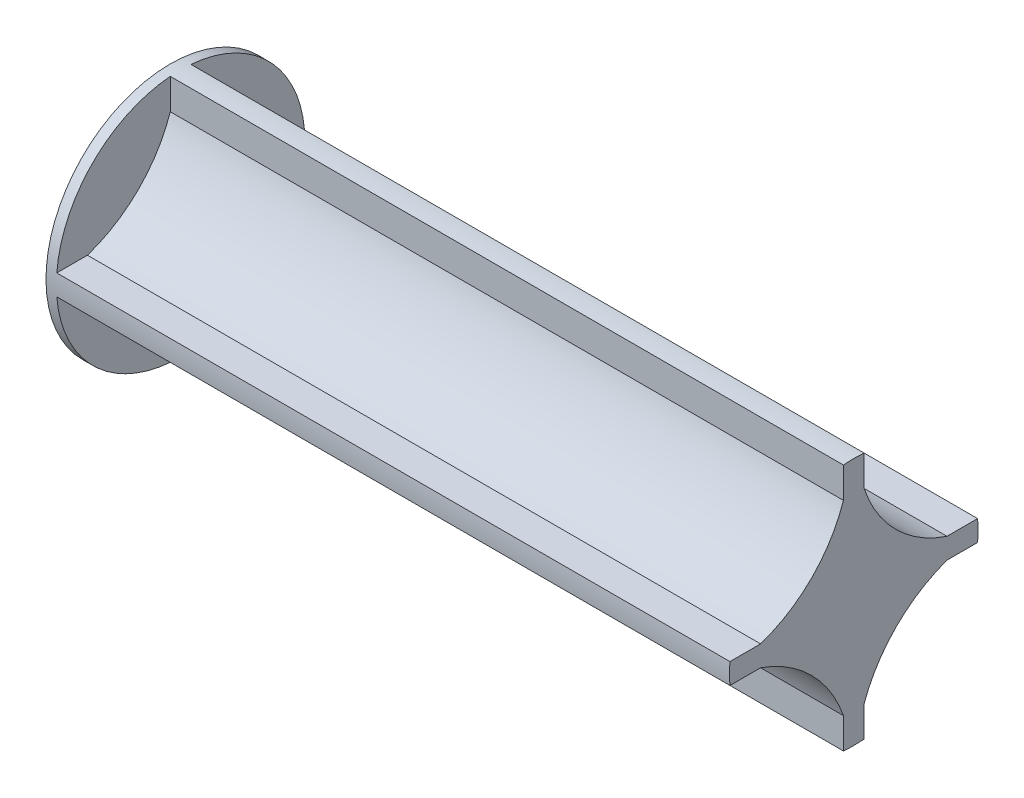
ISO-10303-21;
HEADER;
FILE_DESCRIPTION(('STEP AP214'),'2;1');
FILE_NAME('part.step','',(''),(''),'','','');
FILE_SCHEMA(('AUTOMOTIVE_DESIGN { 1 0 10303 214 1 1 1 1 }'));
ENDSEC;
DATA;
#1=APPLICATION_CONTEXT('core data for automotive mechanical design processes');
#2=APPLICATION_PROTOCOL_DEFINITION('international standard','automotive_design',2000,#1);
#3=PRODUCT_CONTEXT('',#1,'mechanical');
#4=PRODUCT('Part','Part','',(#3));
#5=PRODUCT_RELATED_PRODUCT_CATEGORY('part','',(#4));
#6=PRODUCT_DEFINITION_FORMATION('','',#4);
#7=PRODUCT_DEFINITION_CONTEXT('part definition',#1,'design');
#8=PRODUCT_DEFINITION('design','',#6,#7);
#9=PRODUCT_DEFINITION_SHAPE('','',#8);
#10=(LENGTH_UNIT() NAMED_UNIT(*) SI_UNIT(.MILLI.,.METRE.));
#11=(NAMED_UNIT(*) PLANE_ANGLE_UNIT() SI_UNIT($,.RADIAN.));
#12=(NAMED_UNIT(*) SI_UNIT($,.STERADIAN.) SOLID_ANGLE_UNIT());
#13=UNCERTAINTY_MEASURE_WITH_UNIT(LENGTH_MEASURE(1.E-05),#10,'distance_accuracy_value','');
#14=(GEOMETRIC_REPRESENTATION_CONTEXT(3) GLOBAL_UNCERTAINTY_ASSIGNED_CONTEXT((#13)) GLOBAL_UNIT_ASSIGNED_CONTEXT((#10,
#11,#12)) REPRESENTATION_CONTEXT('',''));
#15=CARTESIAN_POINT('',(0.,0.,0.));
#16=DIRECTION('',(0.,0.,1.));
#17=DIRECTION('',(1.,0.,0.));
#18=AXIS2_PLACEMENT_3D('',#15,#16,#17);
#19=CARTESIAN_POINT('',(66.,0.,0.));
#20=DIRECTION('',(-1.,0.,0.));
#21=DIRECTION('',(0.,0.,1.));
#22=AXIS2_PLACEMENT_3D('',#19,#20,#21);
#23=CYLINDRICAL_SURFACE('',#22,12.);
#24=CARTESIAN_POINT('',(0.,0.,0.));
#25=DIRECTION('',(1.,0.,0.));
#26=DIRECTION('',(0.,0.,-1.));
#27=AXIS2_PLACEMENT_3D('',#24,#25,#26);
#28=CIRCLE('',#27,12.);
#29=CARTESIAN_POINT('',(0.,0.,-12.));
#30=VERTEX_POINT('',#29);
#31=EDGE_CURVE('E359',#30,#30,#28,.T.);
#32=ORIENTED_EDGE('',*,*,#31,.T.);
#33=EDGE_LOOP('',(#32));
#34=FACE_BOUND('',#33,.T.);
#35=DIRECTION('',(1.,0.,0.));
#36=VECTOR('',#35,1.);
#37=CARTESIAN_POINT('',(1.,-11.9582607431014,0.999999999999843));
#38=LINE('',#37,#36);
#39=CARTESIAN_POINT('',(1.,-11.9582607431014,0.999999999999843));
#40=VERTEX_POINT('',#39);
#41=CARTESIAN_POINT('',(66.,-11.9582607431014,0.999999999999843));
#42=VERTEX_POINT('',#41);
#43=EDGE_CURVE('E274',#40,#42,#38,.T.);
#44=ORIENTED_EDGE('',*,*,#43,.F.);
#45=CARTESIAN_POINT('',(1.,0.,0.));
#46=DIRECTION('',(1.,0.,0.));
#47=DIRECTION('',(0.,0.,-1.));
#48=AXIS2_PLACEMENT_3D('',#45,#46,#47);
#49=CIRCLE('',#48,12.);
#50=CARTESIAN_POINT('',(1.,-1.00000000000026,11.9582607431014));
#51=VERTEX_POINT('',#50);
#52=EDGE_CURVE('E253',#51,#40,#49,.T.);
#53=ORIENTED_EDGE('',*,*,#52,.F.);
#54=DIRECTION('',(1.,0.,0.));
#55=VECTOR('',#54,1.);
#56=CARTESIAN_POINT('',(1.,-1.00000000000026,11.9582607431014));
#57=LINE('',#56,#55);
#58=CARTESIAN_POINT('',(66.,-1.00000000000026,11.9582607431014));
#59=VERTEX_POINT('',#58);
#60=EDGE_CURVE('E276',#51,#59,#57,.T.);
#61=ORIENTED_EDGE('',*,*,#60,.T.);
#62=CARTESIAN_POINT('',(66.,0.,0.));
#63=DIRECTION('',(1.,0.,0.));
#64=DIRECTION('',(0.,0.,-1.));
#65=AXIS2_PLACEMENT_3D('',#62,#63,#64);
#66=CIRCLE('',#65,12.);
#67=CARTESIAN_POINT('',(66.,1.00000000000002,11.9582607431014));
#68=VERTEX_POINT('',#67);
#69=EDGE_CURVE('E367',#68,#59,#66,.T.);
#70=ORIENTED_EDGE('',*,*,#69,.F.);
#71=DIRECTION('',(1.,0.,0.));
#72=VECTOR('',#71,1.);
#73=CARTESIAN_POINT('',(1.,1.00000000000002,11.9582607431014));
#74=LINE('',#73,#72);
#75=CARTESIAN_POINT('',(1.,1.00000000000002,11.9582607431014));
#76=VERTEX_POINT('',#75);
#77=EDGE_CURVE('E357',#76,#68,#74,.T.);
#78=ORIENTED_EDGE('',*,*,#77,.F.);
#79=CARTESIAN_POINT('',(1.,0.,0.));
#80=DIRECTION('',(1.,0.,0.));
#81=DIRECTION('',(0.,0.,-1.));
#82=AXIS2_PLACEMENT_3D('',#79,#80,#81);
#83=CIRCLE('',#82,12.);
#84=CARTESIAN_POINT('',(1.,11.9582607431014,1.00000000000002));
#85=VERTEX_POINT('',#84);
#86=EDGE_CURVE('E347',#85,#76,#83,.T.);
#87=ORIENTED_EDGE('',*,*,#86,.F.);
#88=DIRECTION('',(1.,0.,0.));
#89=VECTOR('',#88,1.);
#90=CARTESIAN_POINT('',(1.,11.9582607431014,1.00000000000002));
#91=LINE('',#90,#89);
#92=CARTESIAN_POINT('',(66.,11.9582607431014,1.00000000000002));
#93=VERTEX_POINT('',#92);
#94=EDGE_CURVE('E360',#85,#93,#91,.T.);
#95=ORIENTED_EDGE('',*,*,#94,.T.);
#96=CARTESIAN_POINT('',(66.,11.9582607431014,-1.));
#97=VERTEX_POINT('',#96);
#98=EDGE_CURVE('E371',#97,#93,#66,.T.);
#99=ORIENTED_EDGE('',*,*,#98,.F.);
#100=DIRECTION('',(1.,0.,0.));
#101=VECTOR('',#100,1.);
#102=CARTESIAN_POINT('',(1.,11.9582607431014,-1.));
#103=LINE('',#102,#101);
#104=CARTESIAN_POINT('',(1.,11.9582607431014,-1.));
#105=VERTEX_POINT('',#104);
#106=EDGE_CURVE('E331',#105,#97,#103,.T.);
#107=ORIENTED_EDGE('',*,*,#106,.F.);
#108=CARTESIAN_POINT('',(1.,0.,0.));
#109=DIRECTION('',(1.,0.,0.));
#110=DIRECTION('',(0.,0.,-1.));
#111=AXIS2_PLACEMENT_3D('',#108,#109,#110);
#112=CIRCLE('',#111,12.);
#113=CARTESIAN_POINT('',(1.,0.999999999999858,-11.9582607431014));
#114=VERTEX_POINT('',#113);
#115=EDGE_CURVE('E315',#114,#105,#112,.T.);
#116=ORIENTED_EDGE('',*,*,#115,.F.);
#117=DIRECTION('',(1.,0.,0.));
#118=VECTOR('',#117,1.);
#119=CARTESIAN_POINT('',(1.,0.999999999999858,-11.9582607431014));
#120=LINE('',#119,#118);
#121=CARTESIAN_POINT('',(66.,0.999999999999858,-11.9582607431014));
#122=VERTEX_POINT('',#121);
#123=EDGE_CURVE('E333',#114,#122,#120,.T.);
#124=ORIENTED_EDGE('',*,*,#123,.T.);
#125=CARTESIAN_POINT('',(66.,-1.00000000000008,-11.9582607431014));
#126=VERTEX_POINT('',#125);
#127=EDGE_CURVE('E383',#126,#122,#66,.T.);
#128=ORIENTED_EDGE('',*,*,#127,.F.);
#129=DIRECTION('',(1.,0.,0.));
#130=VECTOR('',#129,1.);
#131=CARTESIAN_POINT('',(1.,-1.00000000000008,-11.9582607431014));
#132=LINE('',#131,#130);
#133=CARTESIAN_POINT('',(1.,-1.00000000000008,-11.9582607431014));
#134=VERTEX_POINT('',#133);
#135=EDGE_CURVE('E303',#134,#126,#132,.T.);
#136=ORIENTED_EDGE('',*,*,#135,.F.);
#137=CARTESIAN_POINT('',(1.,0.,0.));
#138=DIRECTION('',(1.,0.,0.));
#139=DIRECTION('',(0.,0.,-1.));
#140=AXIS2_PLACEMENT_3D('',#137,#138,#139);
#141=CIRCLE('',#140,12.);
#142=CARTESIAN_POINT('',(1.,-11.9582607431014,-1.));
#143=VERTEX_POINT('',#142);
#144=EDGE_CURVE('E288',#143,#134,#141,.T.);
#145=ORIENTED_EDGE('',*,*,#144,.F.);
#146=DIRECTION('',(1.,0.,0.));
#147=VECTOR('',#146,1.);
#148=CARTESIAN_POINT('',(1.,-11.9582607431014,-1.));
#149=LINE('',#148,#147);
#150=CARTESIAN_POINT('',(66.,-11.9582607431014,-1.));
#151=VERTEX_POINT('',#150);
#152=EDGE_CURVE('E305',#143,#151,#149,.T.);
#153=ORIENTED_EDGE('',*,*,#152,.T.);
#154=EDGE_CURVE('E370',#42,#151,#66,.T.);
#155=ORIENTED_EDGE('',*,*,#154,.F.);
#156=EDGE_LOOP('',(#44,#53,#61,#70,#78,#87,#95,#99,#107,#116,#124,#128,#136,#145,#153,#155));
#157=FACE_BOUND('',#156,.T.);
#158=ADVANCED_FACE('F35',(#34,#157),#23,.T.);
#159=CARTESIAN_POINT('',(66.,0.,0.));
#160=DIRECTION('',(1.,0.,0.));
#161=DIRECTION('',(0.,0.,-1.));
#162=AXIS2_PLACEMENT_3D('',#159,#160,#161);
#163=PLANE('',#162);
#164=CARTESIAN_POINT('',(66.,-13.30515446821,13.3051544682096));
#165=DIRECTION('',(1.,0.,0.));
#166=DIRECTION('',(0.,0.,-1.));
#167=AXIS2_PLACEMENT_3D('',#164,#165,#166);
#168=CIRCLE('',#167,13.0365325712648);
#169=CARTESIAN_POINT('',(66.,-9.00000000000013,0.999999999999899));
#170=VERTEX_POINT('',#169);
#171=CARTESIAN_POINT('',(66.,-1.00000000000024,8.99999999999998));
#172=VERTEX_POINT('',#171);
#173=EDGE_CURVE('E269',#170,#172,#168,.T.);
#174=ORIENTED_EDGE('',*,*,#173,.F.);
#175=DIRECTION('',(0.,-1.,0.));
#176=VECTOR('',#175,1.);
#177=CARTESIAN_POINT('',(66.,0.,0.999999999999931));
#178=LINE('',#177,#176);
#179=EDGE_CURVE('E50',#170,#42,#178,.T.);
#180=ORIENTED_EDGE('',*,*,#179,.T.);
#181=ORIENTED_EDGE('',*,*,#154,.T.);
#182=DIRECTION('',(0.,-1.,0.));
#183=VECTOR('',#182,1.);
#184=CARTESIAN_POINT('',(66.,0.,-1.));
#185=LINE('',#184,#183);
#186=CARTESIAN_POINT('',(66.,-9.0000000000001,-1.));
#187=VERTEX_POINT('',#186);
#188=EDGE_CURVE('E295',#187,#151,#185,.T.);
#189=ORIENTED_EDGE('',*,*,#188,.F.);
#190=CARTESIAN_POINT('',(66.,-13.5100557553755,-13.5100557553756));
#191=DIRECTION('',(1.,0.,0.));
#192=DIRECTION('',(0.,0.,-1.));
#193=AXIS2_PLACEMENT_3D('',#190,#191,#192);
#194=CIRCLE('',#193,13.2981990479613);
#195=CARTESIAN_POINT('',(66.,-1.00000000000011,-8.99999999999994));
#196=VERTEX_POINT('',#195);
#197=EDGE_CURVE('E58',#187,#196,#194,.F.);
#198=ORIENTED_EDGE('',*,*,#197,.T.);
#199=DIRECTION('',(0.,0.,-1.));
#200=VECTOR('',#199,1.);
#201=CARTESIAN_POINT('',(66.,-1.00000000000017,0.));
#202=LINE('',#201,#200);
#203=EDGE_CURVE('E285',#196,#126,#202,.T.);
#204=ORIENTED_EDGE('',*,*,#203,.T.);
#205=ORIENTED_EDGE('',*,*,#127,.T.);
#206=DIRECTION('',(0.,0.,-1.));
#207=VECTOR('',#206,1.);
#208=CARTESIAN_POINT('',(66.,0.999999999999937,0.));
#209=LINE('',#208,#207);
#210=CARTESIAN_POINT('',(66.,0.999999999999878,-8.99999999999995));
#211=VERTEX_POINT('',#210);
#212=EDGE_CURVE('E323',#211,#122,#209,.T.);
#213=ORIENTED_EDGE('',*,*,#212,.F.);
#214=CARTESIAN_POINT('',(66.,12.9455938380272,-12.9455938380273));
#215=DIRECTION('',(1.,0.,0.));
#216=DIRECTION('',(0.,0.,-1.));
#217=AXIS2_PLACEMENT_3D('',#214,#215,#216);
#218=CIRCLE('',#217,12.5803387425695);
#219=CARTESIAN_POINT('',(66.,8.99999999999988,-1.));
#220=VERTEX_POINT('',#219);
#221=EDGE_CURVE('E302',#211,#220,#218,.F.);
#222=ORIENTED_EDGE('',*,*,#221,.T.);
#223=DIRECTION('',(0.,-1.,0.));
#224=VECTOR('',#223,1.);
#225=CARTESIAN_POINT('',(66.,0.,-1.));
#226=LINE('',#225,#224);
#227=EDGE_CURVE('E312',#97,#220,#226,.T.);
#228=ORIENTED_EDGE('',*,*,#227,.F.);
#229=ORIENTED_EDGE('',*,*,#98,.T.);
#230=DIRECTION('',(0.,-1.,0.));
#231=VECTOR('',#230,1.);
#232=CARTESIAN_POINT('',(66.,0.,0.999999999999931));
#233=LINE('',#232,#231);
#234=CARTESIAN_POINT('',(66.,9.,0.999999999999997));
#235=VERTEX_POINT('',#234);
#236=EDGE_CURVE('E342',#93,#235,#233,.T.);
#237=ORIENTED_EDGE('',*,*,#236,.T.);
#238=CARTESIAN_POINT('',(66.,13.0095924704432,13.0095924704432));
#239=DIRECTION('',(1.,0.,0.));
#240=DIRECTION('',(0.,0.,-1.));
#241=AXIS2_PLACEMENT_3D('',#238,#239,#240);
#242=CIRCLE('',#241,12.6612457161671);
#243=CARTESIAN_POINT('',(66.,0.999999999999964,9.00000000000001));
#244=VERTEX_POINT('',#243);
#245=EDGE_CURVE('E352',#244,#235,#242,.T.);
#246=ORIENTED_EDGE('',*,*,#245,.F.);
#247=DIRECTION('',(0.,0.,-1.));
#248=VECTOR('',#247,1.);
#249=CARTESIAN_POINT('',(66.,0.9999999999997,0.));
#250=LINE('',#249,#248);
#251=EDGE_CURVE('E330',#68,#244,#250,.T.);
#252=ORIENTED_EDGE('',*,*,#251,.F.);
#253=ORIENTED_EDGE('',*,*,#69,.T.);
#254=DIRECTION('',(0.,0.,-1.));
#255=VECTOR('',#254,1.);
#256=CARTESIAN_POINT('',(66.,-1.00000000000017,0.));
#257=LINE('',#256,#255);
#258=EDGE_CURVE('E255',#59,#172,#257,.T.);
#259=ORIENTED_EDGE('',*,*,#258,.T.);
#260=EDGE_LOOP('',(#174,#180,#181,#189,#198,#204,#205,#213,#222,#228,#229,#237,#246,#252,#253,#259));
#261=FACE_BOUND('',#260,.T.);
#262=ADVANCED_FACE('F162',(#261),#163,.T.);
#263=CARTESIAN_POINT('',(0.,0.,0.));
#264=DIRECTION('',(1.,0.,0.));
#265=DIRECTION('',(0.,0.,-1.));
#266=AXIS2_PLACEMENT_3D('',#263,#264,#265);
#267=PLANE('',#266);
#268=CARTESIAN_POINT('',(0.,0.,0.));
#269=DIRECTION('',(1.,0.,0.));
#270=DIRECTION('',(0.,0.,-1.));
#271=AXIS2_PLACEMENT_3D('',#268,#269,#270);
#272=CIRCLE('',#271,6.25);
#273=CARTESIAN_POINT('',(0.,0.,-6.25));
#274=VERTEX_POINT('',#273);
#275=EDGE_CURVE('E11',#274,#274,#272,.T.);
#276=ORIENTED_EDGE('',*,*,#275,.T.);
#277=EDGE_LOOP('',(#276));
#278=FACE_BOUND('',#277,.T.);
#279=ORIENTED_EDGE('',*,*,#31,.F.);
#280=EDGE_LOOP('',(#279));
#281=FACE_BOUND('',#280,.T.);
#282=ADVANCED_FACE('F167',(#278,#281),#267,.F.);
#283=CARTESIAN_POINT('',(50.,0.,0.));
#284=DIRECTION('',(-1.,0.,0.));
#285=DIRECTION('',(0.,0.,1.));
#286=AXIS2_PLACEMENT_3D('',#283,#284,#285);
#287=CYLINDRICAL_SURFACE('',#286,5.25);
#288=CARTESIAN_POINT('',(1.,0.,0.));
#289=DIRECTION('',(1.,0.,0.));
#290=DIRECTION('',(0.,0.,-1.));
#291=AXIS2_PLACEMENT_3D('',#288,#289,#290);
#292=CIRCLE('',#291,5.25);
#293=CARTESIAN_POINT('',(1.,0.,-5.25));
#294=VERTEX_POINT('',#293);
#295=EDGE_CURVE('E43',#294,#294,#292,.F.);
#296=ORIENTED_EDGE('',*,*,#295,.T.);
#297=EDGE_LOOP('',(#296));
#298=FACE_BOUND('',#297,.T.);
#299=CARTESIAN_POINT('',(50.,0.,0.));
#300=DIRECTION('',(1.,0.,0.));
#301=DIRECTION('',(0.,0.,-1.));
#302=AXIS2_PLACEMENT_3D('',#299,#300,#301);
#303=CIRCLE('',#302,5.25);
#304=CARTESIAN_POINT('',(50.,0.,-5.25));
#305=VERTEX_POINT('',#304);
#306=EDGE_CURVE('E270',#305,#305,#303,.F.);
#307=ORIENTED_EDGE('',*,*,#306,.F.);
#308=EDGE_LOOP('',(#307));
#309=FACE_BOUND('',#308,.T.);
#310=ADVANCED_FACE('F174',(#298,#309),#287,.F.);
#311=CARTESIAN_POINT('',(1.,0.9999999999997,0.));
#312=DIRECTION('',(0.,-1.,0.));
#313=DIRECTION('',(0.,0.,-1.));
#314=AXIS2_PLACEMENT_3D('',#311,#312,#313);
#315=PLANE('',#314);
#316=ORIENTED_EDGE('',*,*,#251,.T.);
#317=DIRECTION('',(1.,0.,0.));
#318=VECTOR('',#317,1.);
#319=CARTESIAN_POINT('',(1.,0.999999999999939,8.99999999999999));
#320=LINE('',#319,#318);
#321=CARTESIAN_POINT('',(1.,0.999999999999939,8.99999999999999));
#322=VERTEX_POINT('',#321);
#323=EDGE_CURVE('E350',#322,#244,#320,.T.);
#324=ORIENTED_EDGE('',*,*,#323,.F.);
#325=DIRECTION('',(0.,0.,-1.));
#326=VECTOR('',#325,1.);
#327=CARTESIAN_POINT('',(1.,0.9999999999997,0.));
#328=LINE('',#327,#326);
#329=EDGE_CURVE('E338',#76,#322,#328,.T.);
#330=ORIENTED_EDGE('',*,*,#329,.F.);
#331=ORIENTED_EDGE('',*,*,#77,.T.);
#332=EDGE_LOOP('',(#316,#324,#330,#331));
#333=FACE_BOUND('',#332,.T.);
#334=ADVANCED_FACE('F179',(#333),#315,.F.);
#335=CARTESIAN_POINT('',(1.,0.,0.999999999999931));
#336=DIRECTION('',(0.,0.,1.));
#337=DIRECTION('',(0.,-1.,0.));
#338=AXIS2_PLACEMENT_3D('',#335,#336,#337);
#339=PLANE('',#338);
#340=ORIENTED_EDGE('',*,*,#236,.F.);
#341=ORIENTED_EDGE('',*,*,#94,.F.);
#342=DIRECTION('',(0.,-1.,0.));
#343=VECTOR('',#342,1.);
#344=CARTESIAN_POINT('',(1.,0.,0.999999999999931));
#345=LINE('',#344,#343);
#346=CARTESIAN_POINT('',(1.,9.,0.999999999999997));
#347=VERTEX_POINT('',#346);
#348=EDGE_CURVE('E345',#85,#347,#345,.T.);
#349=ORIENTED_EDGE('',*,*,#348,.T.);
#350=DIRECTION('',(1.,0.,0.));
#351=VECTOR('',#350,1.);
#352=CARTESIAN_POINT('',(1.,9.,0.999999999999997));
#353=LINE('',#352,#351);
#354=EDGE_CURVE('E363',#347,#235,#353,.T.);
#355=ORIENTED_EDGE('',*,*,#354,.T.);
#356=EDGE_LOOP('',(#340,#341,#349,#355));
#357=FACE_BOUND('',#356,.T.);
#358=ADVANCED_FACE('F183',(#357),#339,.T.);
#359=CARTESIAN_POINT('',(1.,13.0095924704432,13.0095924704432));
#360=DIRECTION('',(1.,0.,0.));
#361=DIRECTION('',(0.,0.,-1.));
#362=AXIS2_PLACEMENT_3D('',#359,#360,#361);
#363=CYLINDRICAL_SURFACE('',#362,12.6612457161671);
#364=ORIENTED_EDGE('',*,*,#245,.T.);
#365=ORIENTED_EDGE('',*,*,#354,.F.);
#366=CARTESIAN_POINT('',(1.,13.0095924704432,13.0095924704432));
#367=DIRECTION('',(1.,0.,0.));
#368=DIRECTION('',(0.,0.,-1.));
#369=AXIS2_PLACEMENT_3D('',#366,#367,#368);
#370=CIRCLE('',#369,12.6612457161671);
#371=EDGE_CURVE('E341',#322,#347,#370,.T.);
#372=ORIENTED_EDGE('',*,*,#371,.F.);
#373=ORIENTED_EDGE('',*,*,#323,.T.);
#374=EDGE_LOOP('',(#364,#365,#372,#373));
#375=FACE_BOUND('',#374,.T.);
#376=ADVANCED_FACE('F185',(#375),#363,.F.);
#377=CARTESIAN_POINT('',(1.,0.,0.));
#378=DIRECTION('',(1.,0.,0.));
#379=DIRECTION('',(0.,0.,-1.));
#380=AXIS2_PLACEMENT_3D('',#377,#378,#379);
#381=PLANE('',#380);
#382=ORIENTED_EDGE('',*,*,#329,.T.);
#383=ORIENTED_EDGE('',*,*,#371,.T.);
#384=ORIENTED_EDGE('',*,*,#348,.F.);
#385=ORIENTED_EDGE('',*,*,#86,.T.);
#386=EDGE_LOOP('',(#382,#383,#384,#385));
#387=FACE_BOUND('',#386,.T.);
#388=ADVANCED_FACE('F188',(#387),#381,.T.);
#389=CARTESIAN_POINT('',(1.,12.9455938380272,-12.9455938380273));
#390=DIRECTION('',(1.,0.,0.));
#391=DIRECTION('',(0.,0.,-1.));
#392=AXIS2_PLACEMENT_3D('',#389,#390,#391);
#393=CYLINDRICAL_SURFACE('',#392,12.5803387425695);
#394=ORIENTED_EDGE('',*,*,#221,.F.);
#395=DIRECTION('',(1.,0.,0.));
#396=VECTOR('',#395,1.);
#397=CARTESIAN_POINT('',(1.,0.999999999999878,-8.99999999999995));
#398=LINE('',#397,#396);
#399=CARTESIAN_POINT('',(1.,0.999999999999878,-8.99999999999995));
#400=VERTEX_POINT('',#399);
#401=EDGE_CURVE('E320',#400,#211,#398,.T.);
#402=ORIENTED_EDGE('',*,*,#401,.F.);
#403=CARTESIAN_POINT('',(1.,12.9455938380272,-12.9455938380273));
#404=DIRECTION('',(1.,0.,0.));
#405=DIRECTION('',(0.,0.,-1.));
#406=AXIS2_PLACEMENT_3D('',#403,#404,#405);
#407=CIRCLE('',#406,12.5803387425695);
#408=CARTESIAN_POINT('',(1.,8.99999999999988,-1.));
#409=VERTEX_POINT('',#408);
#410=EDGE_CURVE('E309',#400,#409,#407,.F.);
#411=ORIENTED_EDGE('',*,*,#410,.T.);
#412=DIRECTION('',(1.,0.,0.));
#413=VECTOR('',#412,1.);
#414=CARTESIAN_POINT('',(1.,8.99999999999988,-1.));
#415=LINE('',#414,#413);
#416=EDGE_CURVE('E328',#409,#220,#415,.T.);
#417=ORIENTED_EDGE('',*,*,#416,.T.);
#418=EDGE_LOOP('',(#394,#402,#411,#417));
#419=FACE_BOUND('',#418,.T.);
#420=ADVANCED_FACE('F195',(#419),#393,.F.);
#421=CARTESIAN_POINT('',(1.,0.,-1.));
#422=DIRECTION('',(0.,0.,1.));
#423=DIRECTION('',(0.,-1.,0.));
#424=AXIS2_PLACEMENT_3D('',#421,#422,#423);
#425=PLANE('',#424);
#426=ORIENTED_EDGE('',*,*,#227,.T.);
#427=ORIENTED_EDGE('',*,*,#416,.F.);
#428=DIRECTION('',(0.,-1.,0.));
#429=VECTOR('',#428,1.);
#430=CARTESIAN_POINT('',(1.,0.,-1.));
#431=LINE('',#430,#429);
#432=EDGE_CURVE('E317',#105,#409,#431,.T.);
#433=ORIENTED_EDGE('',*,*,#432,.F.);
#434=ORIENTED_EDGE('',*,*,#106,.T.);
#435=EDGE_LOOP('',(#426,#427,#433,#434));
#436=FACE_BOUND('',#435,.T.);
#437=ADVANCED_FACE('F199',(#436),#425,.F.);
#438=CARTESIAN_POINT('',(1.,0.999999999999937,0.));
#439=DIRECTION('',(0.,-1.,0.));
#440=DIRECTION('',(0.,0.,-1.));
#441=AXIS2_PLACEMENT_3D('',#438,#439,#440);
#442=PLANE('',#441);
#443=ORIENTED_EDGE('',*,*,#212,.T.);
#444=ORIENTED_EDGE('',*,*,#123,.F.);
#445=DIRECTION('',(0.,0.,-1.));
#446=VECTOR('',#445,1.);
#447=CARTESIAN_POINT('',(1.,0.999999999999937,0.));
#448=LINE('',#447,#446);
#449=EDGE_CURVE('E311',#400,#114,#448,.T.);
#450=ORIENTED_EDGE('',*,*,#449,.F.);
#451=ORIENTED_EDGE('',*,*,#401,.T.);
#452=EDGE_LOOP('',(#443,#444,#450,#451));
#453=FACE_BOUND('',#452,.T.);
#454=ADVANCED_FACE('F201',(#453),#442,.F.);
#455=CARTESIAN_POINT('',(1.,0.,0.));
#456=DIRECTION('',(1.,0.,0.));
#457=DIRECTION('',(0.,0.,-1.));
#458=AXIS2_PLACEMENT_3D('',#455,#456,#457);
#459=PLANE('',#458);
#460=ORIENTED_EDGE('',*,*,#410,.F.);
#461=ORIENTED_EDGE('',*,*,#449,.T.);
#462=ORIENTED_EDGE('',*,*,#115,.T.);
#463=ORIENTED_EDGE('',*,*,#432,.T.);
#464=EDGE_LOOP('',(#460,#461,#462,#463));
#465=FACE_BOUND('',#464,.T.);
#466=ADVANCED_FACE('F204',(#465),#459,.T.);
#467=CARTESIAN_POINT('',(1.,-13.5100557553755,-13.5100557553756));
#468=DIRECTION('',(1.,0.,0.));
#469=DIRECTION('',(0.,0.,-1.));
#470=AXIS2_PLACEMENT_3D('',#467,#468,#469);
#471=CYLINDRICAL_SURFACE('',#470,13.2981990479613);
#472=ORIENTED_EDGE('',*,*,#197,.F.);
#473=DIRECTION('',(1.,0.,0.));
#474=VECTOR('',#473,1.);
#475=CARTESIAN_POINT('',(1.,-9.0000000000001,-1.));
#476=LINE('',#475,#474);
#477=CARTESIAN_POINT('',(1.,-9.0000000000001,-1.));
#478=VERTEX_POINT('',#477);
#479=EDGE_CURVE('E293',#478,#187,#476,.T.);
#480=ORIENTED_EDGE('',*,*,#479,.F.);
#481=CARTESIAN_POINT('',(1.,-13.5100557553755,-13.5100557553756));
#482=DIRECTION('',(1.,0.,0.));
#483=DIRECTION('',(0.,0.,-1.));
#484=AXIS2_PLACEMENT_3D('',#481,#482,#483);
#485=CIRCLE('',#484,13.2981990479613);
#486=CARTESIAN_POINT('',(1.,-1.00000000000011,-8.99999999999994));
#487=VERTEX_POINT('',#486);
#488=EDGE_CURVE('E281',#478,#487,#485,.F.);
#489=ORIENTED_EDGE('',*,*,#488,.T.);
#490=DIRECTION('',(1.,0.,0.));
#491=VECTOR('',#490,1.);
#492=CARTESIAN_POINT('',(1.,-1.00000000000011,-8.99999999999994));
#493=LINE('',#492,#491);
#494=EDGE_CURVE('E300',#487,#196,#493,.T.);
#495=ORIENTED_EDGE('',*,*,#494,.T.);
#496=EDGE_LOOP('',(#472,#480,#489,#495));
#497=FACE_BOUND('',#496,.T.);
#498=ADVANCED_FACE('F211',(#497),#471,.F.);
#499=CARTESIAN_POINT('',(1.,-1.00000000000017,0.));
#500=DIRECTION('',(0.,-1.,0.));
#501=DIRECTION('',(0.,0.,-1.));
#502=AXIS2_PLACEMENT_3D('',#499,#500,#501);
#503=PLANE('',#502);
#504=ORIENTED_EDGE('',*,*,#203,.F.);
#505=ORIENTED_EDGE('',*,*,#494,.F.);
#506=DIRECTION('',(0.,0.,-1.));
#507=VECTOR('',#506,1.);
#508=CARTESIAN_POINT('',(1.,-1.00000000000017,0.));
#509=LINE('',#508,#507);
#510=EDGE_CURVE('E291',#487,#134,#509,.T.);
#511=ORIENTED_EDGE('',*,*,#510,.T.);
#512=ORIENTED_EDGE('',*,*,#135,.T.);
#513=EDGE_LOOP('',(#504,#505,#511,#512));
#514=FACE_BOUND('',#513,.T.);
#515=ADVANCED_FACE('F215',(#514),#503,.T.);
#516=CARTESIAN_POINT('',(1.,0.,-1.));
#517=DIRECTION('',(0.,0.,1.));
#518=DIRECTION('',(0.,-1.,0.));
#519=AXIS2_PLACEMENT_3D('',#516,#517,#518);
#520=PLANE('',#519);
#521=ORIENTED_EDGE('',*,*,#188,.T.);
#522=ORIENTED_EDGE('',*,*,#152,.F.);
#523=DIRECTION('',(0.,-1.,0.));
#524=VECTOR('',#523,1.);
#525=CARTESIAN_POINT('',(1.,0.,-1.));
#526=LINE('',#525,#524);
#527=EDGE_CURVE('E284',#478,#143,#526,.T.);
#528=ORIENTED_EDGE('',*,*,#527,.F.);
#529=ORIENTED_EDGE('',*,*,#479,.T.);
#530=EDGE_LOOP('',(#521,#522,#528,#529));
#531=FACE_BOUND('',#530,.T.);
#532=ADVANCED_FACE('F216',(#531),#520,.F.);
#533=CARTESIAN_POINT('',(1.,0.,0.));
#534=DIRECTION('',(1.,0.,0.));
#535=DIRECTION('',(0.,0.,-1.));
#536=AXIS2_PLACEMENT_3D('',#533,#534,#535);
#537=PLANE('',#536);
#538=ORIENTED_EDGE('',*,*,#488,.F.);
#539=ORIENTED_EDGE('',*,*,#527,.T.);
#540=ORIENTED_EDGE('',*,*,#144,.T.);
#541=ORIENTED_EDGE('',*,*,#510,.F.);
#542=EDGE_LOOP('',(#538,#539,#540,#541));
#543=FACE_BOUND('',#542,.T.);
#544=ADVANCED_FACE('F219',(#543),#537,.T.);
#545=CARTESIAN_POINT('',(1.,0.,0.999999999999931));
#546=DIRECTION('',(0.,0.,1.));
#547=DIRECTION('',(0.,-1.,0.));
#548=AXIS2_PLACEMENT_3D('',#545,#546,#547);
#549=PLANE('',#548);
#550=ORIENTED_EDGE('',*,*,#179,.F.);
#551=DIRECTION('',(1.,0.,0.));
#552=VECTOR('',#551,1.);
#553=CARTESIAN_POINT('',(1.,-9.00000000000012,0.999999999999865));
#554=LINE('',#553,#552);
#555=CARTESIAN_POINT('',(1.,-9.00000000000012,0.999999999999865));
#556=VERTEX_POINT('',#555);
#557=EDGE_CURVE('E259',#556,#170,#554,.T.);
#558=ORIENTED_EDGE('',*,*,#557,.F.);
#559=DIRECTION('',(0.,-1.,0.));
#560=VECTOR('',#559,1.);
#561=CARTESIAN_POINT('',(1.,0.,0.999999999999931));
#562=LINE('',#561,#560);
#563=EDGE_CURVE('E248',#556,#40,#562,.T.);
#564=ORIENTED_EDGE('',*,*,#563,.T.);
#565=ORIENTED_EDGE('',*,*,#43,.T.);
#566=EDGE_LOOP('',(#550,#558,#564,#565));
#567=FACE_BOUND('',#566,.T.);
#568=ADVANCED_FACE('F226',(#567),#549,.T.);
#569=CARTESIAN_POINT('',(1.,-1.00000000000017,0.));
#570=DIRECTION('',(0.,-1.,0.));
#571=DIRECTION('',(0.,0.,-1.));
#572=AXIS2_PLACEMENT_3D('',#569,#570,#571);
#573=PLANE('',#572);
#574=ORIENTED_EDGE('',*,*,#258,.F.);
#575=ORIENTED_EDGE('',*,*,#60,.F.);
#576=DIRECTION('',(0.,0.,-1.));
#577=VECTOR('',#576,1.);
#578=CARTESIAN_POINT('',(1.,-1.00000000000017,0.));
#579=LINE('',#578,#577);
#580=CARTESIAN_POINT('',(1.,-1.00000000000024,8.99999999999998));
#581=VERTEX_POINT('',#580);
#582=EDGE_CURVE('E262',#51,#581,#579,.T.);
#583=ORIENTED_EDGE('',*,*,#582,.T.);
#584=DIRECTION('',(1.,0.,0.));
#585=VECTOR('',#584,1.);
#586=CARTESIAN_POINT('',(1.,-1.00000000000024,8.99999999999998));
#587=LINE('',#586,#585);
#588=EDGE_CURVE('E261',#581,#172,#587,.T.);
#589=ORIENTED_EDGE('',*,*,#588,.T.);
#590=EDGE_LOOP('',(#574,#575,#583,#589));
#591=FACE_BOUND('',#590,.T.);
#592=ADVANCED_FACE('F230',(#591),#573,.T.);
#593=CARTESIAN_POINT('',(1.,-13.30515446821,13.3051544682096));
#594=DIRECTION('',(1.,0.,0.));
#595=DIRECTION('',(0.,0.,-1.));
#596=AXIS2_PLACEMENT_3D('',#593,#594,#595);
#597=CYLINDRICAL_SURFACE('',#596,13.0365325712648);
#598=ORIENTED_EDGE('',*,*,#173,.T.);
#599=ORIENTED_EDGE('',*,*,#588,.F.);
#600=CARTESIAN_POINT('',(1.,-13.30515446821,13.3051544682096));
#601=DIRECTION('',(1.,0.,0.));
#602=DIRECTION('',(0.,0.,-1.));
#603=AXIS2_PLACEMENT_3D('',#600,#601,#602);
#604=CIRCLE('',#603,13.0365325712648);
#605=EDGE_CURVE('E251',#556,#581,#604,.T.);
#606=ORIENTED_EDGE('',*,*,#605,.F.);
#607=ORIENTED_EDGE('',*,*,#557,.T.);
#608=EDGE_LOOP('',(#598,#599,#606,#607));
#609=FACE_BOUND('',#608,.T.);
#610=ADVANCED_FACE('F231',(#609),#597,.F.);
#611=CARTESIAN_POINT('',(1.,0.,0.));
#612=DIRECTION('',(1.,0.,0.));
#613=DIRECTION('',(0.,0.,-1.));
#614=AXIS2_PLACEMENT_3D('',#611,#612,#613);
#615=PLANE('',#614);
#616=ORIENTED_EDGE('',*,*,#563,.F.);
#617=ORIENTED_EDGE('',*,*,#605,.T.);
#618=ORIENTED_EDGE('',*,*,#582,.F.);
#619=ORIENTED_EDGE('',*,*,#52,.T.);
#620=EDGE_LOOP('',(#616,#617,#618,#619));
#621=FACE_BOUND('',#620,.T.);
#622=ADVANCED_FACE('F234',(#621),#615,.T.);
#623=CARTESIAN_POINT('',(1.,0.,0.));
#624=DIRECTION('',(1.,0.,0.));
#625=DIRECTION('',(0.,0.,-1.));
#626=AXIS2_PLACEMENT_3D('',#623,#624,#625);
#627=TOROIDAL_SURFACE('',#626,6.25,1.);
#628=ORIENTED_EDGE('',*,*,#275,.F.);
#629=EDGE_LOOP('',(#628));
#630=FACE_BOUND('',#629,.T.);
#631=ORIENTED_EDGE('',*,*,#295,.F.);
#632=EDGE_LOOP('',(#631));
#633=FACE_BOUND('',#632,.T.);
#634=ADVANCED_FACE('F37',(#630,#633),#627,.T.);
#635=CARTESIAN_POINT('',(50.,0.,0.));
#636=DIRECTION('',(1.,0.,0.));
#637=DIRECTION('',(0.,0.,-1.));
#638=AXIS2_PLACEMENT_3D('',#635,#636,#637);
#639=PLANE('',#638);
#640=CARTESIAN_POINT('',(50.,0.,0.));
#641=DIRECTION('',(-1.,0.,0.));
#642=DIRECTION('',(0.,0.,1.));
#643=AXIS2_PLACEMENT_3D('',#640,#641,#642);
#644=CIRCLE('',#643,5.5);
#645=CARTESIAN_POINT('',(50.,0.,5.5));
#646=VERTEX_POINT('',#645);
#647=EDGE_CURVE('E379',#646,#646,#644,.T.);
#648=ORIENTED_EDGE('',*,*,#647,.F.);
#649=EDGE_LOOP('',(#648));
#650=FACE_BOUND('',#649,.T.);
#651=ORIENTED_EDGE('',*,*,#306,.T.);
#652=EDGE_LOOP('',(#651));
#653=FACE_BOUND('',#652,.T.);
#654=ADVANCED_FACE('F152',(#650,#653),#639,.T.);
#655=CARTESIAN_POINT('',(48.8023337790793,0.,-15.3740809620651));
#656=DIRECTION('',(0.,-1.,0.));
#657=DIRECTION('',(0.,0.,1.));
#658=AXIS2_PLACEMENT_3D('',#655,#656,#657);
#659=CIRCLE('',#658,20.9084112353757);
#660=TRIMMED_CURVE('',#659,(PARAMETER_VALUE(-0.744678201062498)),
(PARAMETER_VALUE(0.744678201062498)),.T.,.PARAMETER.);
#661=CARTESIAN_POINT('',(48.8023337790793,0.,0.));
#662=DIRECTION('',(-1.,0.,0.));
#663=AXIS1_PLACEMENT('',#661,#662);
#664=SURFACE_OF_REVOLUTION('',#660,#663);
#665=ORIENTED_EDGE('',*,*,#647,.T.);
#666=EDGE_LOOP('',(#665));
#667=FACE_BOUND('',#666,.T.);
#668=CARTESIAN_POINT('',(62.9727005689493,0.,0.));
#669=VERTEX_POINT('',#668);
#670=VERTEX_LOOP('',#669);
#671=FACE_BOUND('',#670,.T.);
#672=ADVANCED_FACE('F150',(#667,#671),#664,.F.);
#673=CLOSED_SHELL('',(#158,#262,#282,#310,#334,#358,#376,#388,#420,#437,#454,#466,#498,#515,
#532,#544,#568,#592,#610,#622,#634,#654,#672));
#674=MANIFOLD_SOLID_BREP('B2',#673);
#675=ADVANCED_BREP_SHAPE_REPRESENTATION('',(#18,#674),#14);
#676=SHAPE_DEFINITION_REPRESENTATION(#9,#675);
ENDSEC;
END-ISO-10303-21;
